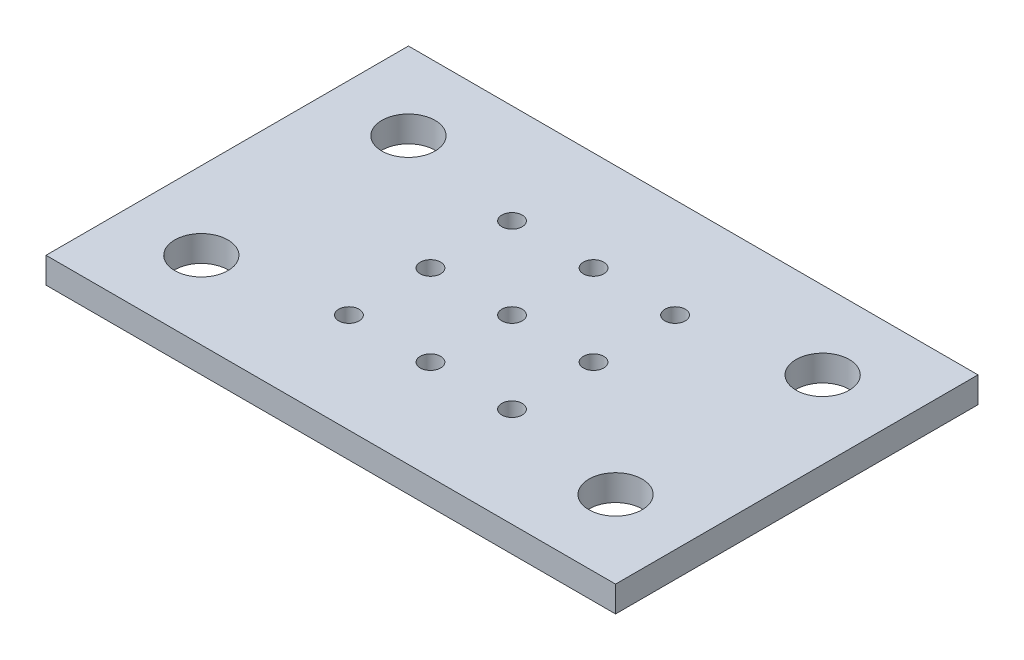
ISO-10303-21;
HEADER;
FILE_DESCRIPTION(('STEP AP214'),'2;1');
FILE_NAME('part.step','',(''),(''),'','','');
FILE_SCHEMA(('AUTOMOTIVE_DESIGN { 1 0 10303 214 1 1 1 1 }'));
ENDSEC;
DATA;
#1=APPLICATION_CONTEXT('core data for automotive mechanical design processes');
#2=APPLICATION_PROTOCOL_DEFINITION('international standard','automotive_design',2000,#1);
#3=PRODUCT_CONTEXT('',#1,'mechanical');
#4=PRODUCT('Part','Part','',(#3));
#5=PRODUCT_RELATED_PRODUCT_CATEGORY('part','',(#4));
#6=PRODUCT_DEFINITION_FORMATION('','',#4);
#7=PRODUCT_DEFINITION_CONTEXT('part definition',#1,'design');
#8=PRODUCT_DEFINITION('design','',#6,#7);
#9=PRODUCT_DEFINITION_SHAPE('','',#8);
#10=(LENGTH_UNIT() NAMED_UNIT(*) SI_UNIT(.MILLI.,.METRE.));
#11=(NAMED_UNIT(*) PLANE_ANGLE_UNIT() SI_UNIT($,.RADIAN.));
#12=(NAMED_UNIT(*) SI_UNIT($,.STERADIAN.) SOLID_ANGLE_UNIT());
#13=UNCERTAINTY_MEASURE_WITH_UNIT(LENGTH_MEASURE(1.E-05),#10,'distance_accuracy_value','');
#14=(GEOMETRIC_REPRESENTATION_CONTEXT(3) GLOBAL_UNCERTAINTY_ASSIGNED_CONTEXT((#13)) GLOBAL_UNIT_ASSIGNED_CONTEXT((#10,
#11,#12)) REPRESENTATION_CONTEXT('',''));
#15=CARTESIAN_POINT('',(0.,0.,0.));
#16=DIRECTION('',(0.,0.,1.));
#17=DIRECTION('',(1.,0.,0.));
#18=AXIS2_PLACEMENT_3D('',#15,#16,#17);
#19=CARTESIAN_POINT('',(0.,3.175,0.));
#20=DIRECTION('',(0.,0.,-1.));
#21=DIRECTION('',(-1.,0.,0.));
#22=AXIS2_PLACEMENT_3D('',#19,#20,#21);
#23=PLANE('',#22);
#24=DIRECTION('',(1.,0.,0.));
#25=VECTOR('',#24,1.);
#26=CARTESIAN_POINT('',(0.,0.,0.));
#27=LINE('',#26,#25);
#28=CARTESIAN_POINT('',(0.,0.,0.));
#29=VERTEX_POINT('',#28);
#30=CARTESIAN_POINT('',(69.85,0.,0.));
#31=VERTEX_POINT('',#30);
#32=EDGE_CURVE('E168',#29,#31,#27,.T.);
#33=ORIENTED_EDGE('',*,*,#32,.T.);
#34=DIRECTION('',(0.,-1.,0.));
#35=VECTOR('',#34,1.);
#36=CARTESIAN_POINT('',(69.85,3.175,0.));
#37=LINE('',#36,#35);
#38=CARTESIAN_POINT('',(69.85,3.175,0.));
#39=VERTEX_POINT('',#38);
#40=EDGE_CURVE('E11',#39,#31,#37,.T.);
#41=ORIENTED_EDGE('',*,*,#40,.F.);
#42=DIRECTION('',(1.,0.,0.));
#43=VECTOR('',#42,1.);
#44=CARTESIAN_POINT('',(0.,3.175,0.));
#45=LINE('',#44,#43);
#46=CARTESIAN_POINT('',(0.,3.175,0.));
#47=VERTEX_POINT('',#46);
#48=EDGE_CURVE('E98',#47,#39,#45,.T.);
#49=ORIENTED_EDGE('',*,*,#48,.F.);
#50=DIRECTION('',(0.,-1.,0.));
#51=VECTOR('',#50,1.);
#52=CARTESIAN_POINT('',(0.,3.175,0.));
#53=LINE('',#52,#51);
#54=EDGE_CURVE('E65',#47,#29,#53,.T.);
#55=ORIENTED_EDGE('',*,*,#54,.T.);
#56=EDGE_LOOP('',(#33,#41,#49,#55));
#57=FACE_BOUND('',#56,.T.);
#58=ADVANCED_FACE('F47',(#57),#23,.F.);
#59=CARTESIAN_POINT('',(69.85,3.175,0.));
#60=DIRECTION('',(-1.,0.,0.));
#61=DIRECTION('',(0.,0.,1.));
#62=AXIS2_PLACEMENT_3D('',#59,#60,#61);
#63=PLANE('',#62);
#64=DIRECTION('',(0.,0.,-1.));
#65=VECTOR('',#64,1.);
#66=CARTESIAN_POINT('',(69.85,0.,0.));
#67=LINE('',#66,#65);
#68=CARTESIAN_POINT('',(69.85,0.,-44.45));
#69=VERTEX_POINT('',#68);
#70=EDGE_CURVE('E104',#31,#69,#67,.T.);
#71=ORIENTED_EDGE('',*,*,#70,.T.);
#72=DIRECTION('',(0.,-1.,0.));
#73=VECTOR('',#72,1.);
#74=CARTESIAN_POINT('',(69.85,3.175,-44.45));
#75=LINE('',#74,#73);
#76=CARTESIAN_POINT('',(69.85,3.175,-44.45));
#77=VERTEX_POINT('',#76);
#78=EDGE_CURVE('E57',#77,#69,#75,.T.);
#79=ORIENTED_EDGE('',*,*,#78,.F.);
#80=DIRECTION('',(0.,0.,-1.));
#81=VECTOR('',#80,1.);
#82=CARTESIAN_POINT('',(69.85,3.175,0.));
#83=LINE('',#82,#81);
#84=EDGE_CURVE('E90',#39,#77,#83,.T.);
#85=ORIENTED_EDGE('',*,*,#84,.F.);
#86=ORIENTED_EDGE('',*,*,#40,.T.);
#87=EDGE_LOOP('',(#71,#79,#85,#86));
#88=FACE_BOUND('',#87,.T.);
#89=ADVANCED_FACE('F103',(#88),#63,.F.);
#90=CARTESIAN_POINT('',(0.,3.175,-44.45));
#91=DIRECTION('',(0.,0.,-1.));
#92=DIRECTION('',(-1.,0.,0.));
#93=AXIS2_PLACEMENT_3D('',#90,#91,#92);
#94=PLANE('',#93);
#95=DIRECTION('',(1.,0.,0.));
#96=VECTOR('',#95,1.);
#97=CARTESIAN_POINT('',(0.,0.,-44.45));
#98=LINE('',#97,#96);
#99=CARTESIAN_POINT('',(0.,0.,-44.45));
#100=VERTEX_POINT('',#99);
#101=EDGE_CURVE('E173',#100,#69,#98,.T.);
#102=ORIENTED_EDGE('',*,*,#101,.F.);
#103=DIRECTION('',(0.,-1.,0.));
#104=VECTOR('',#103,1.);
#105=CARTESIAN_POINT('',(0.,3.175,-44.45));
#106=LINE('',#105,#104);
#107=CARTESIAN_POINT('',(0.,3.175,-44.45));
#108=VERTEX_POINT('',#107);
#109=EDGE_CURVE('E79',#108,#100,#106,.T.);
#110=ORIENTED_EDGE('',*,*,#109,.F.);
#111=DIRECTION('',(1.,0.,0.));
#112=VECTOR('',#111,1.);
#113=CARTESIAN_POINT('',(0.,3.175,-44.45));
#114=LINE('',#113,#112);
#115=EDGE_CURVE('E97',#108,#77,#114,.T.);
#116=ORIENTED_EDGE('',*,*,#115,.T.);
#117=ORIENTED_EDGE('',*,*,#78,.T.);
#118=EDGE_LOOP('',(#102,#110,#116,#117));
#119=FACE_BOUND('',#118,.T.);
#120=ADVANCED_FACE('F108',(#119),#94,.T.);
#121=CARTESIAN_POINT('',(9.525,3.175,-34.925));
#122=DIRECTION('',(0.,-1.,0.));
#123=DIRECTION('',(0.,0.,-1.));
#124=AXIS2_PLACEMENT_3D('',#121,#122,#123);
#125=CYLINDRICAL_SURFACE('',#124,3.2639);
#126=CARTESIAN_POINT('',(9.525,3.175,-34.925));
#127=DIRECTION('',(0.,1.,0.));
#128=DIRECTION('',(0.,0.,1.));
#129=AXIS2_PLACEMENT_3D('',#126,#127,#128);
#130=CIRCLE('',#129,3.2639);
#131=CARTESIAN_POINT('',(9.525,3.175,-31.6611));
#132=VERTEX_POINT('',#131);
#133=EDGE_CURVE('E235',#132,#132,#130,.T.);
#134=ORIENTED_EDGE('',*,*,#133,.T.);
#135=EDGE_LOOP('',(#134));
#136=FACE_BOUND('',#135,.T.);
#137=CARTESIAN_POINT('',(9.525,0.,-34.925));
#138=DIRECTION('',(0.,1.,0.));
#139=DIRECTION('',(0.,0.,1.));
#140=AXIS2_PLACEMENT_3D('',#137,#138,#139);
#141=CIRCLE('',#140,3.2639);
#142=CARTESIAN_POINT('',(9.525,0.,-31.6611));
#143=VERTEX_POINT('',#142);
#144=EDGE_CURVE('E164',#143,#143,#141,.T.);
#145=ORIENTED_EDGE('',*,*,#144,.F.);
#146=EDGE_LOOP('',(#145));
#147=FACE_BOUND('',#146,.T.);
#148=ADVANCED_FACE('F241',(#136,#147),#125,.F.);
#149=CARTESIAN_POINT('',(60.325,3.175,-34.925));
#150=DIRECTION('',(0.,-1.,0.));
#151=DIRECTION('',(0.,0.,-1.));
#152=AXIS2_PLACEMENT_3D('',#149,#150,#151);
#153=CYLINDRICAL_SURFACE('',#152,3.2639);
#154=CARTESIAN_POINT('',(60.325,3.175,-34.925));
#155=DIRECTION('',(0.,1.,0.));
#156=DIRECTION('',(0.,0.,1.));
#157=AXIS2_PLACEMENT_3D('',#154,#155,#156);
#158=CIRCLE('',#157,3.2639);
#159=CARTESIAN_POINT('',(60.325,3.175,-31.6611));
#160=VERTEX_POINT('',#159);
#161=EDGE_CURVE('E231',#160,#160,#158,.T.);
#162=ORIENTED_EDGE('',*,*,#161,.T.);
#163=EDGE_LOOP('',(#162));
#164=FACE_BOUND('',#163,.T.);
#165=CARTESIAN_POINT('',(60.325,0.,-34.925));
#166=DIRECTION('',(0.,1.,0.));
#167=DIRECTION('',(0.,0.,1.));
#168=AXIS2_PLACEMENT_3D('',#165,#166,#167);
#169=CIRCLE('',#168,3.2639);
#170=CARTESIAN_POINT('',(60.325,0.,-31.6611));
#171=VERTEX_POINT('',#170);
#172=EDGE_CURVE('E160',#171,#171,#169,.T.);
#173=ORIENTED_EDGE('',*,*,#172,.F.);
#174=EDGE_LOOP('',(#173));
#175=FACE_BOUND('',#174,.T.);
#176=ADVANCED_FACE('F267',(#164,#175),#153,.F.);
#177=CARTESIAN_POINT('',(9.525,3.175,-9.525));
#178=DIRECTION('',(0.,-1.,0.));
#179=DIRECTION('',(0.,0.,-1.));
#180=AXIS2_PLACEMENT_3D('',#177,#178,#179);
#181=CYLINDRICAL_SURFACE('',#180,3.2639);
#182=CARTESIAN_POINT('',(9.525,3.175,-9.525));
#183=DIRECTION('',(0.,1.,0.));
#184=DIRECTION('',(0.,0.,1.));
#185=AXIS2_PLACEMENT_3D('',#182,#183,#184);
#186=CIRCLE('',#185,3.2639);
#187=CARTESIAN_POINT('',(9.525,3.175,-6.2611));
#188=VERTEX_POINT('',#187);
#189=EDGE_CURVE('E227',#188,#188,#186,.T.);
#190=ORIENTED_EDGE('',*,*,#189,.T.);
#191=EDGE_LOOP('',(#190));
#192=FACE_BOUND('',#191,.T.);
#193=CARTESIAN_POINT('',(9.525,0.,-9.525));
#194=DIRECTION('',(0.,1.,0.));
#195=DIRECTION('',(0.,0.,1.));
#196=AXIS2_PLACEMENT_3D('',#193,#194,#195);
#197=CIRCLE('',#196,3.2639);
#198=CARTESIAN_POINT('',(9.525,0.,-6.2611));
#199=VERTEX_POINT('',#198);
#200=EDGE_CURVE('E156',#199,#199,#197,.T.);
#201=ORIENTED_EDGE('',*,*,#200,.F.);
#202=EDGE_LOOP('',(#201));
#203=FACE_BOUND('',#202,.T.);
#204=ADVANCED_FACE('F270',(#192,#203),#181,.F.);
#205=CARTESIAN_POINT('',(60.325,3.175,-9.525));
#206=DIRECTION('',(0.,-1.,0.));
#207=DIRECTION('',(0.,0.,-1.));
#208=AXIS2_PLACEMENT_3D('',#205,#206,#207);
#209=CYLINDRICAL_SURFACE('',#208,3.2639);
#210=CARTESIAN_POINT('',(60.325,3.175,-9.525));
#211=DIRECTION('',(0.,1.,0.));
#212=DIRECTION('',(0.,0.,1.));
#213=AXIS2_PLACEMENT_3D('',#210,#211,#212);
#214=CIRCLE('',#213,3.2639);
#215=CARTESIAN_POINT('',(60.325,3.175,-6.2611));
#216=VERTEX_POINT('',#215);
#217=EDGE_CURVE('E223',#216,#216,#214,.T.);
#218=ORIENTED_EDGE('',*,*,#217,.T.);
#219=EDGE_LOOP('',(#218));
#220=FACE_BOUND('',#219,.T.);
#221=CARTESIAN_POINT('',(60.325,0.,-9.525));
#222=DIRECTION('',(0.,1.,0.));
#223=DIRECTION('',(0.,0.,1.));
#224=AXIS2_PLACEMENT_3D('',#221,#222,#223);
#225=CIRCLE('',#224,3.2639);
#226=CARTESIAN_POINT('',(60.325,0.,-6.2611));
#227=VERTEX_POINT('',#226);
#228=EDGE_CURVE('E152',#227,#227,#225,.T.);
#229=ORIENTED_EDGE('',*,*,#228,.F.);
#230=EDGE_LOOP('',(#229));
#231=FACE_BOUND('',#230,.T.);
#232=ADVANCED_FACE('F274',(#220,#231),#209,.F.);
#233=CARTESIAN_POINT('',(34.925,3.175,-22.225));
#234=DIRECTION('',(0.,-1.,0.));
#235=DIRECTION('',(0.,0.,-1.));
#236=AXIS2_PLACEMENT_3D('',#233,#234,#235);
#237=CYLINDRICAL_SURFACE('',#236,1.25);
#238=CARTESIAN_POINT('',(34.925,3.175,-22.225));
#239=DIRECTION('',(0.,1.,0.));
#240=DIRECTION('',(0.,0.,1.));
#241=AXIS2_PLACEMENT_3D('',#238,#239,#240);
#242=CIRCLE('',#241,1.25);
#243=CARTESIAN_POINT('',(34.925,3.175,-20.975));
#244=VERTEX_POINT('',#243);
#245=EDGE_CURVE('E219',#244,#244,#242,.T.);
#246=ORIENTED_EDGE('',*,*,#245,.T.);
#247=EDGE_LOOP('',(#246));
#248=FACE_BOUND('',#247,.T.);
#249=CARTESIAN_POINT('',(34.925,0.,-22.225));
#250=DIRECTION('',(0.,1.,0.));
#251=DIRECTION('',(0.,0.,1.));
#252=AXIS2_PLACEMENT_3D('',#249,#250,#251);
#253=CIRCLE('',#252,1.25);
#254=CARTESIAN_POINT('',(34.925,0.,-20.975));
#255=VERTEX_POINT('',#254);
#256=EDGE_CURVE('E148',#255,#255,#253,.T.);
#257=ORIENTED_EDGE('',*,*,#256,.F.);
#258=EDGE_LOOP('',(#257));
#259=FACE_BOUND('',#258,.T.);
#260=ADVANCED_FACE('F278',(#248,#259),#237,.F.);
#261=CARTESIAN_POINT('',(44.925,3.175,-22.225));
#262=DIRECTION('',(0.,-1.,0.));
#263=DIRECTION('',(0.,0.,-1.));
#264=AXIS2_PLACEMENT_3D('',#261,#262,#263);
#265=CYLINDRICAL_SURFACE('',#264,1.25);
#266=CARTESIAN_POINT('',(44.925,3.175,-22.225));
#267=DIRECTION('',(0.,1.,0.));
#268=DIRECTION('',(0.,0.,1.));
#269=AXIS2_PLACEMENT_3D('',#266,#267,#268);
#270=CIRCLE('',#269,1.25);
#271=CARTESIAN_POINT('',(44.925,3.175,-20.975));
#272=VERTEX_POINT('',#271);
#273=EDGE_CURVE('E215',#272,#272,#270,.T.);
#274=ORIENTED_EDGE('',*,*,#273,.T.);
#275=EDGE_LOOP('',(#274));
#276=FACE_BOUND('',#275,.T.);
#277=CARTESIAN_POINT('',(44.925,0.,-22.225));
#278=DIRECTION('',(0.,1.,0.));
#279=DIRECTION('',(0.,0.,1.));
#280=AXIS2_PLACEMENT_3D('',#277,#278,#279);
#281=CIRCLE('',#280,1.25);
#282=CARTESIAN_POINT('',(44.925,0.,-20.975));
#283=VERTEX_POINT('',#282);
#284=EDGE_CURVE('E144',#283,#283,#281,.T.);
#285=ORIENTED_EDGE('',*,*,#284,.F.);
#286=EDGE_LOOP('',(#285));
#287=FACE_BOUND('',#286,.T.);
#288=ADVANCED_FACE('F282',(#276,#287),#265,.F.);
#289=CARTESIAN_POINT('',(44.925,3.175,-32.225));
#290=DIRECTION('',(0.,-1.,0.));
#291=DIRECTION('',(0.,0.,-1.));
#292=AXIS2_PLACEMENT_3D('',#289,#290,#291);
#293=CYLINDRICAL_SURFACE('',#292,1.25);
#294=CARTESIAN_POINT('',(44.925,3.175,-32.225));
#295=DIRECTION('',(0.,1.,0.));
#296=DIRECTION('',(0.,0.,1.));
#297=AXIS2_PLACEMENT_3D('',#294,#295,#296);
#298=CIRCLE('',#297,1.25);
#299=CARTESIAN_POINT('',(44.925,3.175,-30.975));
#300=VERTEX_POINT('',#299);
#301=EDGE_CURVE('E211',#300,#300,#298,.T.);
#302=ORIENTED_EDGE('',*,*,#301,.T.);
#303=EDGE_LOOP('',(#302));
#304=FACE_BOUND('',#303,.T.);
#305=CARTESIAN_POINT('',(44.925,0.,-32.225));
#306=DIRECTION('',(0.,1.,0.));
#307=DIRECTION('',(0.,0.,1.));
#308=AXIS2_PLACEMENT_3D('',#305,#306,#307);
#309=CIRCLE('',#308,1.25);
#310=CARTESIAN_POINT('',(44.925,0.,-30.975));
#311=VERTEX_POINT('',#310);
#312=EDGE_CURVE('E140',#311,#311,#309,.T.);
#313=ORIENTED_EDGE('',*,*,#312,.F.);
#314=EDGE_LOOP('',(#313));
#315=FACE_BOUND('',#314,.T.);
#316=ADVANCED_FACE('F286',(#304,#315),#293,.F.);
#317=CARTESIAN_POINT('',(34.925,3.175,-32.225));
#318=DIRECTION('',(0.,-1.,0.));
#319=DIRECTION('',(0.,0.,-1.));
#320=AXIS2_PLACEMENT_3D('',#317,#318,#319);
#321=CYLINDRICAL_SURFACE('',#320,1.25);
#322=CARTESIAN_POINT('',(34.925,3.175,-32.225));
#323=DIRECTION('',(0.,1.,0.));
#324=DIRECTION('',(0.,0.,1.));
#325=AXIS2_PLACEMENT_3D('',#322,#323,#324);
#326=CIRCLE('',#325,1.25);
#327=CARTESIAN_POINT('',(34.925,3.175,-30.975));
#328=VERTEX_POINT('',#327);
#329=EDGE_CURVE('E207',#328,#328,#326,.T.);
#330=ORIENTED_EDGE('',*,*,#329,.T.);
#331=EDGE_LOOP('',(#330));
#332=FACE_BOUND('',#331,.T.);
#333=CARTESIAN_POINT('',(34.925,0.,-32.225));
#334=DIRECTION('',(0.,1.,0.));
#335=DIRECTION('',(0.,0.,1.));
#336=AXIS2_PLACEMENT_3D('',#333,#334,#335);
#337=CIRCLE('',#336,1.25);
#338=CARTESIAN_POINT('',(34.925,0.,-30.975));
#339=VERTEX_POINT('',#338);
#340=EDGE_CURVE('E136',#339,#339,#337,.T.);
#341=ORIENTED_EDGE('',*,*,#340,.F.);
#342=EDGE_LOOP('',(#341));
#343=FACE_BOUND('',#342,.T.);
#344=ADVANCED_FACE('F290',(#332,#343),#321,.F.);
#345=CARTESIAN_POINT('',(24.925,3.175,-22.2249999999999));
#346=DIRECTION('',(0.,-1.,0.));
#347=DIRECTION('',(0.,0.,-1.));
#348=AXIS2_PLACEMENT_3D('',#345,#346,#347);
#349=CYLINDRICAL_SURFACE('',#348,1.25);
#350=CARTESIAN_POINT('',(24.925,3.175,-22.2249999999999));
#351=DIRECTION('',(0.,1.,0.));
#352=DIRECTION('',(0.,0.,1.));
#353=AXIS2_PLACEMENT_3D('',#350,#351,#352);
#354=CIRCLE('',#353,1.25);
#355=CARTESIAN_POINT('',(24.925,3.175,-20.9749999999999));
#356=VERTEX_POINT('',#355);
#357=EDGE_CURVE('E203',#356,#356,#354,.T.);
#358=ORIENTED_EDGE('',*,*,#357,.T.);
#359=EDGE_LOOP('',(#358));
#360=FACE_BOUND('',#359,.T.);
#361=CARTESIAN_POINT('',(24.925,0.,-22.2249999999999));
#362=DIRECTION('',(0.,1.,0.));
#363=DIRECTION('',(0.,0.,1.));
#364=AXIS2_PLACEMENT_3D('',#361,#362,#363);
#365=CIRCLE('',#364,1.25);
#366=CARTESIAN_POINT('',(24.925,0.,-20.9749999999999));
#367=VERTEX_POINT('',#366);
#368=EDGE_CURVE('E132',#367,#367,#365,.T.);
#369=ORIENTED_EDGE('',*,*,#368,.F.);
#370=EDGE_LOOP('',(#369));
#371=FACE_BOUND('',#370,.T.);
#372=ADVANCED_FACE('F294',(#360,#371),#349,.F.);
#373=CARTESIAN_POINT('',(24.925,3.175,-32.2249999999999));
#374=DIRECTION('',(0.,-1.,0.));
#375=DIRECTION('',(0.,0.,-1.));
#376=AXIS2_PLACEMENT_3D('',#373,#374,#375);
#377=CYLINDRICAL_SURFACE('',#376,1.25);
#378=CARTESIAN_POINT('',(24.925,3.175,-32.2249999999999));
#379=DIRECTION('',(0.,1.,0.));
#380=DIRECTION('',(0.,0.,1.));
#381=AXIS2_PLACEMENT_3D('',#378,#379,#380);
#382=CIRCLE('',#381,1.25);
#383=CARTESIAN_POINT('',(24.925,3.175,-30.9749999999999));
#384=VERTEX_POINT('',#383);
#385=EDGE_CURVE('E199',#384,#384,#382,.T.);
#386=ORIENTED_EDGE('',*,*,#385,.T.);
#387=EDGE_LOOP('',(#386));
#388=FACE_BOUND('',#387,.T.);
#389=CARTESIAN_POINT('',(24.925,0.,-32.2249999999999));
#390=DIRECTION('',(0.,1.,0.));
#391=DIRECTION('',(0.,0.,1.));
#392=AXIS2_PLACEMENT_3D('',#389,#390,#391);
#393=CIRCLE('',#392,1.25);
#394=CARTESIAN_POINT('',(24.925,0.,-30.9749999999999));
#395=VERTEX_POINT('',#394);
#396=EDGE_CURVE('E128',#395,#395,#393,.T.);
#397=ORIENTED_EDGE('',*,*,#396,.F.);
#398=EDGE_LOOP('',(#397));
#399=FACE_BOUND('',#398,.T.);
#400=ADVANCED_FACE('F298',(#388,#399),#377,.F.);
#401=CARTESIAN_POINT('',(44.9250000000001,3.175,-12.225));
#402=DIRECTION('',(0.,-1.,0.));
#403=DIRECTION('',(0.,0.,-1.));
#404=AXIS2_PLACEMENT_3D('',#401,#402,#403);
#405=CYLINDRICAL_SURFACE('',#404,1.25);
#406=CARTESIAN_POINT('',(44.9250000000001,3.175,-12.225));
#407=DIRECTION('',(0.,1.,0.));
#408=DIRECTION('',(0.,0.,1.));
#409=AXIS2_PLACEMENT_3D('',#406,#407,#408);
#410=CIRCLE('',#409,1.25);
#411=CARTESIAN_POINT('',(44.9250000000001,3.175,-10.975));
#412=VERTEX_POINT('',#411);
#413=EDGE_CURVE('E193',#412,#412,#410,.T.);
#414=ORIENTED_EDGE('',*,*,#413,.T.);
#415=EDGE_LOOP('',(#414));
#416=FACE_BOUND('',#415,.T.);
#417=CARTESIAN_POINT('',(44.9250000000001,0.,-12.225));
#418=DIRECTION('',(0.,1.,0.));
#419=DIRECTION('',(0.,0.,1.));
#420=AXIS2_PLACEMENT_3D('',#417,#418,#419);
#421=CIRCLE('',#420,1.25);
#422=CARTESIAN_POINT('',(44.9250000000001,0.,-10.975));
#423=VERTEX_POINT('',#422);
#424=EDGE_CURVE('E124',#423,#423,#421,.T.);
#425=ORIENTED_EDGE('',*,*,#424,.F.);
#426=EDGE_LOOP('',(#425));
#427=FACE_BOUND('',#426,.T.);
#428=ADVANCED_FACE('F302',(#416,#427),#405,.F.);
#429=CARTESIAN_POINT('',(34.9250000000001,3.175,-12.225));
#430=DIRECTION('',(0.,-1.,0.));
#431=DIRECTION('',(0.,0.,-1.));
#432=AXIS2_PLACEMENT_3D('',#429,#430,#431);
#433=CYLINDRICAL_SURFACE('',#432,1.25);
#434=CARTESIAN_POINT('',(34.9250000000001,3.175,-12.225));
#435=DIRECTION('',(0.,1.,0.));
#436=DIRECTION('',(0.,0.,1.));
#437=AXIS2_PLACEMENT_3D('',#434,#435,#436);
#438=CIRCLE('',#437,1.25);
#439=CARTESIAN_POINT('',(34.9250000000001,3.175,-10.975));
#440=VERTEX_POINT('',#439);
#441=EDGE_CURVE('E187',#440,#440,#438,.T.);
#442=ORIENTED_EDGE('',*,*,#441,.T.);
#443=EDGE_LOOP('',(#442));
#444=FACE_BOUND('',#443,.T.);
#445=CARTESIAN_POINT('',(34.9250000000001,0.,-12.225));
#446=DIRECTION('',(0.,1.,0.));
#447=DIRECTION('',(0.,0.,1.));
#448=AXIS2_PLACEMENT_3D('',#445,#446,#447);
#449=CIRCLE('',#448,1.25);
#450=CARTESIAN_POINT('',(34.9250000000001,0.,-10.975));
#451=VERTEX_POINT('',#450);
#452=EDGE_CURVE('E120',#451,#451,#449,.T.);
#453=ORIENTED_EDGE('',*,*,#452,.F.);
#454=EDGE_LOOP('',(#453));
#455=FACE_BOUND('',#454,.T.);
#456=ADVANCED_FACE('F305',(#444,#455),#433,.F.);
#457=CARTESIAN_POINT('',(24.9250000000001,3.175,-12.2249999999999));
#458=DIRECTION('',(0.,-1.,0.));
#459=DIRECTION('',(0.,0.,-1.));
#460=AXIS2_PLACEMENT_3D('',#457,#458,#459);
#461=CYLINDRICAL_SURFACE('',#460,1.25);
#462=CARTESIAN_POINT('',(24.9250000000001,3.175,-12.2249999999999));
#463=DIRECTION('',(0.,1.,0.));
#464=DIRECTION('',(0.,0.,1.));
#465=AXIS2_PLACEMENT_3D('',#462,#463,#464);
#466=CIRCLE('',#465,1.25);
#467=CARTESIAN_POINT('',(24.9250000000001,3.175,-10.9749999999999));
#468=VERTEX_POINT('',#467);
#469=EDGE_CURVE('E180',#468,#468,#466,.T.);
#470=ORIENTED_EDGE('',*,*,#469,.T.);
#471=EDGE_LOOP('',(#470));
#472=FACE_BOUND('',#471,.T.);
#473=CARTESIAN_POINT('',(24.9250000000001,0.,-12.2249999999999));
#474=DIRECTION('',(0.,1.,0.));
#475=DIRECTION('',(0.,0.,1.));
#476=AXIS2_PLACEMENT_3D('',#473,#474,#475);
#477=CIRCLE('',#476,1.25);
#478=CARTESIAN_POINT('',(24.9250000000001,0.,-10.9749999999999));
#479=VERTEX_POINT('',#478);
#480=EDGE_CURVE('E116',#479,#479,#477,.T.);
#481=ORIENTED_EDGE('',*,*,#480,.F.);
#482=EDGE_LOOP('',(#481));
#483=FACE_BOUND('',#482,.T.);
#484=ADVANCED_FACE('F49',(#472,#483),#461,.F.);
#485=CARTESIAN_POINT('',(0.,3.175,0.));
#486=DIRECTION('',(-1.,0.,0.));
#487=DIRECTION('',(0.,0.,1.));
#488=AXIS2_PLACEMENT_3D('',#485,#486,#487);
#489=PLANE('',#488);
#490=DIRECTION('',(0.,0.,-1.));
#491=VECTOR('',#490,1.);
#492=CARTESIAN_POINT('',(0.,0.,0.));
#493=LINE('',#492,#491);
#494=EDGE_CURVE('E176',#29,#100,#493,.T.);
#495=ORIENTED_EDGE('',*,*,#494,.F.);
#496=ORIENTED_EDGE('',*,*,#54,.F.);
#497=DIRECTION('',(0.,0.,-1.));
#498=VECTOR('',#497,1.);
#499=CARTESIAN_POINT('',(0.,3.175,0.));
#500=LINE('',#499,#498);
#501=EDGE_CURVE('E110',#47,#108,#500,.T.);
#502=ORIENTED_EDGE('',*,*,#501,.T.);
#503=ORIENTED_EDGE('',*,*,#109,.T.);
#504=EDGE_LOOP('',(#495,#496,#502,#503));
#505=FACE_BOUND('',#504,.T.);
#506=ADVANCED_FACE('F246',(#505),#489,.T.);
#507=CARTESIAN_POINT('',(0.,3.175,0.));
#508=DIRECTION('',(0.,1.,0.));
#509=DIRECTION('',(0.,0.,1.));
#510=AXIS2_PLACEMENT_3D('',#507,#508,#509);
#511=PLANE('',#510);
#512=ORIENTED_EDGE('',*,*,#469,.F.);
#513=EDGE_LOOP('',(#512));
#514=FACE_BOUND('',#513,.T.);
#515=ORIENTED_EDGE('',*,*,#441,.F.);
#516=EDGE_LOOP('',(#515));
#517=FACE_BOUND('',#516,.T.);
#518=ORIENTED_EDGE('',*,*,#413,.F.);
#519=EDGE_LOOP('',(#518));
#520=FACE_BOUND('',#519,.T.);
#521=ORIENTED_EDGE('',*,*,#385,.F.);
#522=EDGE_LOOP('',(#521));
#523=FACE_BOUND('',#522,.T.);
#524=ORIENTED_EDGE('',*,*,#357,.F.);
#525=EDGE_LOOP('',(#524));
#526=FACE_BOUND('',#525,.T.);
#527=ORIENTED_EDGE('',*,*,#329,.F.);
#528=EDGE_LOOP('',(#527));
#529=FACE_BOUND('',#528,.T.);
#530=ORIENTED_EDGE('',*,*,#301,.F.);
#531=EDGE_LOOP('',(#530));
#532=FACE_BOUND('',#531,.T.);
#533=ORIENTED_EDGE('',*,*,#273,.F.);
#534=EDGE_LOOP('',(#533));
#535=FACE_BOUND('',#534,.T.);
#536=ORIENTED_EDGE('',*,*,#245,.F.);
#537=EDGE_LOOP('',(#536));
#538=FACE_BOUND('',#537,.T.);
#539=ORIENTED_EDGE('',*,*,#217,.F.);
#540=EDGE_LOOP('',(#539));
#541=FACE_BOUND('',#540,.T.);
#542=ORIENTED_EDGE('',*,*,#189,.F.);
#543=EDGE_LOOP('',(#542));
#544=FACE_BOUND('',#543,.T.);
#545=ORIENTED_EDGE('',*,*,#161,.F.);
#546=EDGE_LOOP('',(#545));
#547=FACE_BOUND('',#546,.T.);
#548=ORIENTED_EDGE('',*,*,#133,.F.);
#549=EDGE_LOOP('',(#548));
#550=FACE_BOUND('',#549,.T.);
#551=ORIENTED_EDGE('',*,*,#48,.T.);
#552=ORIENTED_EDGE('',*,*,#84,.T.);
#553=ORIENTED_EDGE('',*,*,#115,.F.);
#554=ORIENTED_EDGE('',*,*,#501,.F.);
#555=EDGE_LOOP('',(#551,#552,#553,#554));
#556=FACE_BOUND('',#555,.T.);
#557=ADVANCED_FACE('F94',(#514,#517,#520,#523,#526,#529,#532,#535,#538,#541,#544,#547,#550,
#556),#511,.T.);
#558=CARTESIAN_POINT('',(0.,0.,0.));
#559=DIRECTION('',(0.,1.,0.));
#560=DIRECTION('',(0.,0.,1.));
#561=AXIS2_PLACEMENT_3D('',#558,#559,#560);
#562=PLANE('',#561);
#563=ORIENTED_EDGE('',*,*,#480,.T.);
#564=EDGE_LOOP('',(#563));
#565=FACE_BOUND('',#564,.T.);
#566=ORIENTED_EDGE('',*,*,#452,.T.);
#567=EDGE_LOOP('',(#566));
#568=FACE_BOUND('',#567,.T.);
#569=ORIENTED_EDGE('',*,*,#424,.T.);
#570=EDGE_LOOP('',(#569));
#571=FACE_BOUND('',#570,.T.);
#572=ORIENTED_EDGE('',*,*,#396,.T.);
#573=EDGE_LOOP('',(#572));
#574=FACE_BOUND('',#573,.T.);
#575=ORIENTED_EDGE('',*,*,#368,.T.);
#576=EDGE_LOOP('',(#575));
#577=FACE_BOUND('',#576,.T.);
#578=ORIENTED_EDGE('',*,*,#340,.T.);
#579=EDGE_LOOP('',(#578));
#580=FACE_BOUND('',#579,.T.);
#581=ORIENTED_EDGE('',*,*,#312,.T.);
#582=EDGE_LOOP('',(#581));
#583=FACE_BOUND('',#582,.T.);
#584=ORIENTED_EDGE('',*,*,#284,.T.);
#585=EDGE_LOOP('',(#584));
#586=FACE_BOUND('',#585,.T.);
#587=ORIENTED_EDGE('',*,*,#256,.T.);
#588=EDGE_LOOP('',(#587));
#589=FACE_BOUND('',#588,.T.);
#590=ORIENTED_EDGE('',*,*,#228,.T.);
#591=EDGE_LOOP('',(#590));
#592=FACE_BOUND('',#591,.T.);
#593=ORIENTED_EDGE('',*,*,#200,.T.);
#594=EDGE_LOOP('',(#593));
#595=FACE_BOUND('',#594,.T.);
#596=ORIENTED_EDGE('',*,*,#172,.T.);
#597=EDGE_LOOP('',(#596));
#598=FACE_BOUND('',#597,.T.);
#599=ORIENTED_EDGE('',*,*,#144,.T.);
#600=EDGE_LOOP('',(#599));
#601=FACE_BOUND('',#600,.T.);
#602=ORIENTED_EDGE('',*,*,#32,.F.);
#603=ORIENTED_EDGE('',*,*,#494,.T.);
#604=ORIENTED_EDGE('',*,*,#101,.T.);
#605=ORIENTED_EDGE('',*,*,#70,.F.);
#606=EDGE_LOOP('',(#602,#603,#604,#605));
#607=FACE_BOUND('',#606,.T.);
#608=ADVANCED_FACE('F245',(#565,#568,#571,#574,#577,#580,#583,#586,#589,#592,#595,#598,#601,
#607),#562,.F.);
#609=CLOSED_SHELL('',(#58,#89,#120,#148,#176,#204,#232,#260,#288,#316,#344,#372,#400,#428,#456,
#484,#506,#557,#608));
#610=MANIFOLD_SOLID_BREP('B2',#609);
#611=ADVANCED_BREP_SHAPE_REPRESENTATION('',(#18,#610),#14);
#612=SHAPE_DEFINITION_REPRESENTATION(#9,#611);
ENDSEC;
END-ISO-10303-21;
